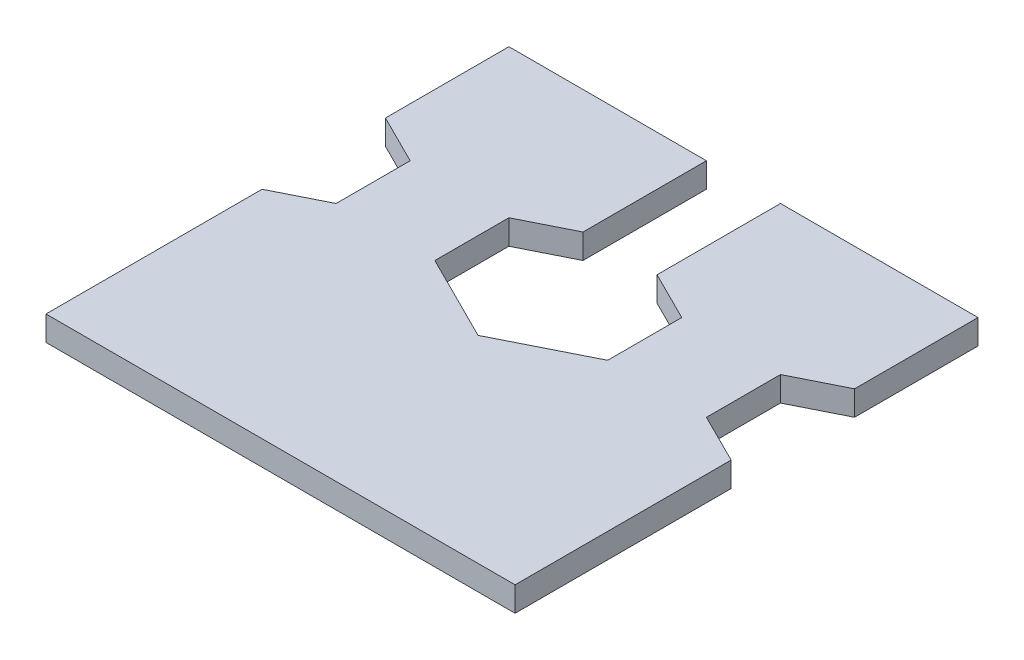
ISO-10303-21;
HEADER;
FILE_DESCRIPTION(('STEP AP214'),'2;1');
FILE_NAME('part.step','',(''),(''),'','','');
FILE_SCHEMA(('AUTOMOTIVE_DESIGN { 1 0 10303 214 1 1 1 1 }'));
ENDSEC;
DATA;
#1=APPLICATION_CONTEXT('core data for automotive mechanical design processes');
#2=APPLICATION_PROTOCOL_DEFINITION('international standard','automotive_design',2000,#1);
#3=PRODUCT_CONTEXT('',#1,'mechanical');
#4=PRODUCT('Part','Part','',(#3));
#5=PRODUCT_RELATED_PRODUCT_CATEGORY('part','',(#4));
#6=PRODUCT_DEFINITION_FORMATION('','',#4);
#7=PRODUCT_DEFINITION_CONTEXT('part definition',#1,'design');
#8=PRODUCT_DEFINITION('design','',#6,#7);
#9=PRODUCT_DEFINITION_SHAPE('','',#8);
#10=(LENGTH_UNIT() NAMED_UNIT(*) SI_UNIT(.MILLI.,.METRE.));
#11=(NAMED_UNIT(*) PLANE_ANGLE_UNIT() SI_UNIT($,.RADIAN.));
#12=(NAMED_UNIT(*) SI_UNIT($,.STERADIAN.) SOLID_ANGLE_UNIT());
#13=UNCERTAINTY_MEASURE_WITH_UNIT(LENGTH_MEASURE(1.E-05),#10,'distance_accuracy_value','');
#14=(GEOMETRIC_REPRESENTATION_CONTEXT(3) GLOBAL_UNCERTAINTY_ASSIGNED_CONTEXT((#13)) GLOBAL_UNIT_ASSIGNED_CONTEXT((#10,
#11,#12)) REPRESENTATION_CONTEXT('',''));
#15=CARTESIAN_POINT('',(0.,0.,0.));
#16=DIRECTION('',(0.,0.,1.));
#17=DIRECTION('',(1.,0.,0.));
#18=AXIS2_PLACEMENT_3D('',#15,#16,#17);
#19=CARTESIAN_POINT('',(-15.,-2.,-19.5007557986155));
#20=DIRECTION('',(-0.447213595499958,0.,-0.894427190999916));
#21=DIRECTION('',(-0.894427190999916,0.,0.447213595499958));
#22=AXIS2_PLACEMENT_3D('',#19,#20,#21);
#23=PLANE('',#22);
#24=DIRECTION('',(-0.894427190999916,0.,0.447213595499958));
#25=VECTOR('',#24,1.);
#26=CARTESIAN_POINT('',(-15.,0.,-19.5007557986155));
#27=LINE('',#26,#25);
#28=CARTESIAN_POINT('',(-15.,0.,-19.5007557986155));
#29=VERTEX_POINT('',#28);
#30=CARTESIAN_POINT('',(-19.,0.,-17.5007557986155));
#31=VERTEX_POINT('',#30);
#32=EDGE_CURVE('E214',#29,#31,#27,.T.);
#33=ORIENTED_EDGE('',*,*,#32,.F.);
#34=DIRECTION('',(0.,1.,0.));
#35=VECTOR('',#34,1.);
#36=CARTESIAN_POINT('',(-15.,-2.,-19.5007557986155));
#37=LINE('',#36,#35);
#38=CARTESIAN_POINT('',(-15.,-2.,-19.5007557986155));
#39=VERTEX_POINT('',#38);
#40=EDGE_CURVE('E11',#39,#29,#37,.T.);
#41=ORIENTED_EDGE('',*,*,#40,.F.);
#42=DIRECTION('',(-0.894427190999916,0.,0.447213595499958));
#43=VECTOR('',#42,1.);
#44=CARTESIAN_POINT('',(-15.,-2.,-19.5007557986155));
#45=LINE('',#44,#43);
#46=CARTESIAN_POINT('',(-19.,-2.,-17.5007557986155));
#47=VERTEX_POINT('',#46);
#48=EDGE_CURVE('E273',#39,#47,#45,.T.);
#49=ORIENTED_EDGE('',*,*,#48,.T.);
#50=DIRECTION('',(0.,1.,0.));
#51=VECTOR('',#50,1.);
#52=CARTESIAN_POINT('',(-19.,-2.,-17.5007557986155));
#53=LINE('',#52,#51);
#54=EDGE_CURVE('E42',#47,#31,#53,.T.);
#55=ORIENTED_EDGE('',*,*,#54,.T.);
#56=EDGE_LOOP('',(#33,#41,#49,#55));
#57=FACE_BOUND('',#56,.T.);
#58=ADVANCED_FACE('F39',(#57),#23,.T.);
#59=CARTESIAN_POINT('',(-15.,-2.,-25.5007557986155));
#60=DIRECTION('',(-1.,0.,0.));
#61=DIRECTION('',(0.,0.,1.));
#62=AXIS2_PLACEMENT_3D('',#59,#60,#61);
#63=PLANE('',#62);
#64=DIRECTION('',(0.,0.,1.));
#65=VECTOR('',#64,1.);
#66=CARTESIAN_POINT('',(-15.,0.,-25.5007557986155));
#67=LINE('',#66,#65);
#68=CARTESIAN_POINT('',(-15.,0.,-25.5007557986155));
#69=VERTEX_POINT('',#68);
#70=EDGE_CURVE('E271',#69,#29,#67,.T.);
#71=ORIENTED_EDGE('',*,*,#70,.F.);
#72=DIRECTION('',(0.,1.,0.));
#73=VECTOR('',#72,1.);
#74=CARTESIAN_POINT('',(-15.,-2.,-25.5007557986155));
#75=LINE('',#74,#73);
#76=CARTESIAN_POINT('',(-15.,-2.,-25.5007557986155));
#77=VERTEX_POINT('',#76);
#78=EDGE_CURVE('E48',#77,#69,#75,.T.);
#79=ORIENTED_EDGE('',*,*,#78,.F.);
#80=DIRECTION('',(0.,0.,1.));
#81=VECTOR('',#80,1.);
#82=CARTESIAN_POINT('',(-15.,-2.,-25.5007557986155));
#83=LINE('',#82,#81);
#84=EDGE_CURVE('E204',#77,#39,#83,.T.);
#85=ORIENTED_EDGE('',*,*,#84,.T.);
#86=ORIENTED_EDGE('',*,*,#40,.T.);
#87=EDGE_LOOP('',(#71,#79,#85,#86));
#88=FACE_BOUND('',#87,.T.);
#89=ADVANCED_FACE('F311',(#88),#63,.T.);
#90=CARTESIAN_POINT('',(-19.,-2.,-27.5007557986155));
#91=DIRECTION('',(-0.447213595499958,0.,0.894427190999916));
#92=DIRECTION('',(0.894427190999916,0.,0.447213595499958));
#93=AXIS2_PLACEMENT_3D('',#90,#91,#92);
#94=PLANE('',#93);
#95=DIRECTION('',(0.894427190999916,0.,0.447213595499958));
#96=VECTOR('',#95,1.);
#97=CARTESIAN_POINT('',(-19.,0.,-27.5007557986155));
#98=LINE('',#97,#96);
#99=CARTESIAN_POINT('',(-19.,0.,-27.5007557986155));
#100=VERTEX_POINT('',#99);
#101=EDGE_CURVE('E191',#100,#69,#98,.T.);
#102=ORIENTED_EDGE('',*,*,#101,.F.);
#103=DIRECTION('',(0.,1.,0.));
#104=VECTOR('',#103,1.);
#105=CARTESIAN_POINT('',(-19.,-2.,-27.5007557986155));
#106=LINE('',#105,#104);
#107=CARTESIAN_POINT('',(-19.,-2.,-27.5007557986155));
#108=VERTEX_POINT('',#107);
#109=EDGE_CURVE('E186',#108,#100,#106,.T.);
#110=ORIENTED_EDGE('',*,*,#109,.F.);
#111=DIRECTION('',(0.894427190999916,0.,0.447213595499958));
#112=VECTOR('',#111,1.);
#113=CARTESIAN_POINT('',(-19.,-2.,-27.5007557986155));
#114=LINE('',#113,#112);
#115=EDGE_CURVE('E189',#108,#77,#114,.T.);
#116=ORIENTED_EDGE('',*,*,#115,.T.);
#117=ORIENTED_EDGE('',*,*,#78,.T.);
#118=EDGE_LOOP('',(#102,#110,#116,#117));
#119=FACE_BOUND('',#118,.T.);
#120=ADVANCED_FACE('F188',(#119),#94,.T.);
#121=CARTESIAN_POINT('',(-19.,-2.,-37.5007557986155));
#122=DIRECTION('',(-1.,0.,0.));
#123=DIRECTION('',(0.,0.,1.));
#124=AXIS2_PLACEMENT_3D('',#121,#122,#123);
#125=PLANE('',#124);
#126=DIRECTION('',(0.,0.,1.));
#127=VECTOR('',#126,1.);
#128=CARTESIAN_POINT('',(-19.,0.,-37.5007557986155));
#129=LINE('',#128,#127);
#130=CARTESIAN_POINT('',(-19.,0.,-37.5007557986155));
#131=VERTEX_POINT('',#130);
#132=EDGE_CURVE('E268',#131,#100,#129,.T.);
#133=ORIENTED_EDGE('',*,*,#132,.F.);
#134=DIRECTION('',(0.,1.,0.));
#135=VECTOR('',#134,1.);
#136=CARTESIAN_POINT('',(-19.,-2.,-37.5007557986155));
#137=LINE('',#136,#135);
#138=CARTESIAN_POINT('',(-19.,-2.,-37.5007557986155));
#139=VERTEX_POINT('',#138);
#140=EDGE_CURVE('E196',#139,#131,#137,.T.);
#141=ORIENTED_EDGE('',*,*,#140,.F.);
#142=DIRECTION('',(0.,0.,1.));
#143=VECTOR('',#142,1.);
#144=CARTESIAN_POINT('',(-19.,-2.,-37.5007557986155));
#145=LINE('',#144,#143);
#146=EDGE_CURVE('E202',#139,#108,#145,.T.);
#147=ORIENTED_EDGE('',*,*,#146,.T.);
#148=ORIENTED_EDGE('',*,*,#109,.T.);
#149=EDGE_LOOP('',(#133,#141,#147,#148));
#150=FACE_BOUND('',#149,.T.);
#151=ADVANCED_FACE('F206',(#150),#125,.T.);
#152=CARTESIAN_POINT('',(-3.,-2.,-37.5007557986155));
#153=DIRECTION('',(0.,0.,-1.));
#154=DIRECTION('',(-1.,0.,0.));
#155=AXIS2_PLACEMENT_3D('',#152,#153,#154);
#156=PLANE('',#155);
#157=DIRECTION('',(-1.,0.,0.));
#158=VECTOR('',#157,1.);
#159=CARTESIAN_POINT('',(-3.,0.,-37.5007557986155));
#160=LINE('',#159,#158);
#161=CARTESIAN_POINT('',(-3.,0.,-37.5007557986155));
#162=VERTEX_POINT('',#161);
#163=EDGE_CURVE('E265',#162,#131,#160,.T.);
#164=ORIENTED_EDGE('',*,*,#163,.F.);
#165=DIRECTION('',(0.,1.,0.));
#166=VECTOR('',#165,1.);
#167=CARTESIAN_POINT('',(-3.,-2.,-37.5007557986155));
#168=LINE('',#167,#166);
#169=CARTESIAN_POINT('',(-3.,-2.,-37.5007557986155));
#170=VERTEX_POINT('',#169);
#171=EDGE_CURVE('E277',#170,#162,#168,.T.);
#172=ORIENTED_EDGE('',*,*,#171,.F.);
#173=DIRECTION('',(-1.,0.,0.));
#174=VECTOR('',#173,1.);
#175=CARTESIAN_POINT('',(-3.,-2.,-37.5007557986155));
#176=LINE('',#175,#174);
#177=EDGE_CURVE('E207',#170,#139,#176,.T.);
#178=ORIENTED_EDGE('',*,*,#177,.T.);
#179=ORIENTED_EDGE('',*,*,#140,.T.);
#180=EDGE_LOOP('',(#164,#172,#178,#179));
#181=FACE_BOUND('',#180,.T.);
#182=ADVANCED_FACE('F324',(#181),#156,.T.);
#183=CARTESIAN_POINT('',(-3.,-2.,-37.5007557986155));
#184=DIRECTION('',(1.,0.,0.));
#185=DIRECTION('',(0.,0.,-1.));
#186=AXIS2_PLACEMENT_3D('',#183,#184,#185);
#187=PLANE('',#186);
#188=DIRECTION('',(0.,0.,-1.));
#189=VECTOR('',#188,1.);
#190=CARTESIAN_POINT('',(-3.,0.,-37.5007557986155));
#191=LINE('',#190,#189);
#192=CARTESIAN_POINT('',(-3.,0.,-27.5007557986155));
#193=VERTEX_POINT('',#192);
#194=EDGE_CURVE('E262',#193,#162,#191,.T.);
#195=ORIENTED_EDGE('',*,*,#194,.F.);
#196=DIRECTION('',(0.,1.,0.));
#197=VECTOR('',#196,1.);
#198=CARTESIAN_POINT('',(-3.,-2.,-27.5007557986155));
#199=LINE('',#198,#197);
#200=CARTESIAN_POINT('',(-3.,-2.,-27.5007557986155));
#201=VERTEX_POINT('',#200);
#202=EDGE_CURVE('E279',#201,#193,#199,.T.);
#203=ORIENTED_EDGE('',*,*,#202,.F.);
#204=DIRECTION('',(0.,0.,-1.));
#205=VECTOR('',#204,1.);
#206=CARTESIAN_POINT('',(-3.,-2.,-37.5007557986155));
#207=LINE('',#206,#205);
#208=EDGE_CURVE('E209',#201,#170,#207,.T.);
#209=ORIENTED_EDGE('',*,*,#208,.T.);
#210=ORIENTED_EDGE('',*,*,#171,.T.);
#211=EDGE_LOOP('',(#195,#203,#209,#210));
#212=FACE_BOUND('',#211,.T.);
#213=ADVANCED_FACE('F327',(#212),#187,.T.);
#214=CARTESIAN_POINT('',(-3.,-2.,-27.5007557986155));
#215=DIRECTION('',(0.447213595499958,0.,0.894427190999916));
#216=DIRECTION('',(0.894427190999916,0.,-0.447213595499958));
#217=AXIS2_PLACEMENT_3D('',#214,#215,#216);
#218=PLANE('',#217);
#219=DIRECTION('',(0.894427190999916,0.,-0.447213595499958));
#220=VECTOR('',#219,1.);
#221=CARTESIAN_POINT('',(-3.,0.,-27.5007557986155));
#222=LINE('',#221,#220);
#223=CARTESIAN_POINT('',(-7.,0.,-25.5007557986155));
#224=VERTEX_POINT('',#223);
#225=EDGE_CURVE('E259',#224,#193,#222,.T.);
#226=ORIENTED_EDGE('',*,*,#225,.F.);
#227=DIRECTION('',(0.,1.,0.));
#228=VECTOR('',#227,1.);
#229=CARTESIAN_POINT('',(-7.,-2.,-25.5007557986155));
#230=LINE('',#229,#228);
#231=CARTESIAN_POINT('',(-7.,-2.,-25.5007557986155));
#232=VERTEX_POINT('',#231);
#233=EDGE_CURVE('E281',#232,#224,#230,.T.);
#234=ORIENTED_EDGE('',*,*,#233,.F.);
#235=DIRECTION('',(0.894427190999916,0.,-0.447213595499958));
#236=VECTOR('',#235,1.);
#237=CARTESIAN_POINT('',(-3.,-2.,-27.5007557986155));
#238=LINE('',#237,#236);
#239=EDGE_CURVE('E622',#232,#201,#238,.T.);
#240=ORIENTED_EDGE('',*,*,#239,.T.);
#241=ORIENTED_EDGE('',*,*,#202,.T.);
#242=EDGE_LOOP('',(#226,#234,#240,#241));
#243=FACE_BOUND('',#242,.T.);
#244=ADVANCED_FACE('F331',(#243),#218,.T.);
#245=CARTESIAN_POINT('',(-7.,-2.,-25.5007557986155));
#246=DIRECTION('',(1.,0.,0.));
#247=DIRECTION('',(0.,0.,-1.));
#248=AXIS2_PLACEMENT_3D('',#245,#246,#247);
#249=PLANE('',#248);
#250=DIRECTION('',(0.,0.,-1.));
#251=VECTOR('',#250,1.);
#252=CARTESIAN_POINT('',(-7.,0.,-25.5007557986155));
#253=LINE('',#252,#251);
#254=CARTESIAN_POINT('',(-7.,0.,-19.5007557986155));
#255=VERTEX_POINT('',#254);
#256=EDGE_CURVE('E256',#255,#224,#253,.T.);
#257=ORIENTED_EDGE('',*,*,#256,.F.);
#258=DIRECTION('',(0.,1.,0.));
#259=VECTOR('',#258,1.);
#260=CARTESIAN_POINT('',(-7.,-2.,-19.5007557986155));
#261=LINE('',#260,#259);
#262=CARTESIAN_POINT('',(-7.,-2.,-19.5007557986155));
#263=VERTEX_POINT('',#262);
#264=EDGE_CURVE('E283',#263,#255,#261,.T.);
#265=ORIENTED_EDGE('',*,*,#264,.F.);
#266=DIRECTION('',(0.,0.,-1.));
#267=VECTOR('',#266,1.);
#268=CARTESIAN_POINT('',(-7.,-2.,-25.5007557986155));
#269=LINE('',#268,#267);
#270=EDGE_CURVE('E626',#263,#232,#269,.T.);
#271=ORIENTED_EDGE('',*,*,#270,.T.);
#272=ORIENTED_EDGE('',*,*,#233,.T.);
#273=EDGE_LOOP('',(#257,#265,#271,#272));
#274=FACE_BOUND('',#273,.T.);
#275=ADVANCED_FACE('F335',(#274),#249,.T.);
#276=CARTESIAN_POINT('',(-7.,-2.,-19.5007557986155));
#277=DIRECTION('',(0.447290848418709,0.,-0.894388560370084));
#278=DIRECTION('',(-0.894388560370084,0.,-0.447290848418709));
#279=AXIS2_PLACEMENT_3D('',#276,#277,#278);
#280=PLANE('',#279);
#281=DIRECTION('',(-0.894388560370084,0.,-0.447290848418709));
#282=VECTOR('',#281,1.);
#283=CARTESIAN_POINT('',(-7.,0.,-19.5007557986155));
#284=LINE('',#283,#282);
#285=CARTESIAN_POINT('',(0.,0.,-16.));
#286=VERTEX_POINT('',#285);
#287=EDGE_CURVE('E253',#286,#255,#284,.T.);
#288=ORIENTED_EDGE('',*,*,#287,.F.);
#289=DIRECTION('',(0.,1.,0.));
#290=VECTOR('',#289,1.);
#291=CARTESIAN_POINT('',(0.,-2.,-16.));
#292=LINE('',#291,#290);
#293=CARTESIAN_POINT('',(0.,-2.,-16.));
#294=VERTEX_POINT('',#293);
#295=EDGE_CURVE('E285',#294,#286,#292,.T.);
#296=ORIENTED_EDGE('',*,*,#295,.F.);
#297=DIRECTION('',(-0.894388560370084,0.,-0.447290848418709));
#298=VECTOR('',#297,1.);
#299=CARTESIAN_POINT('',(-7.,-2.,-19.5007557986155));
#300=LINE('',#299,#298);
#301=EDGE_CURVE('E615',#294,#263,#300,.T.);
#302=ORIENTED_EDGE('',*,*,#301,.T.);
#303=ORIENTED_EDGE('',*,*,#264,.T.);
#304=EDGE_LOOP('',(#288,#296,#302,#303));
#305=FACE_BOUND('',#304,.T.);
#306=ADVANCED_FACE('F339',(#305),#280,.T.);
#307=CARTESIAN_POINT('',(7.,-2.,-19.5007557986155));
#308=DIRECTION('',(-0.447290848418709,0.,-0.894388560370084));
#309=DIRECTION('',(-0.894388560370084,0.,0.447290848418709));
#310=AXIS2_PLACEMENT_3D('',#307,#308,#309);
#311=PLANE('',#310);
#312=DIRECTION('',(-0.894388560370084,0.,0.447290848418709));
#313=VECTOR('',#312,1.);
#314=CARTESIAN_POINT('',(7.,0.,-19.5007557986155));
#315=LINE('',#314,#313);
#316=CARTESIAN_POINT('',(7.,0.,-19.5007557986155));
#317=VERTEX_POINT('',#316);
#318=EDGE_CURVE('E250',#317,#286,#315,.T.);
#319=ORIENTED_EDGE('',*,*,#318,.F.);
#320=DIRECTION('',(0.,1.,0.));
#321=VECTOR('',#320,1.);
#322=CARTESIAN_POINT('',(7.,-2.,-19.5007557986155));
#323=LINE('',#322,#321);
#324=CARTESIAN_POINT('',(7.,-2.,-19.5007557986155));
#325=VERTEX_POINT('',#324);
#326=EDGE_CURVE('E287',#325,#317,#323,.T.);
#327=ORIENTED_EDGE('',*,*,#326,.F.);
#328=DIRECTION('',(-0.894388560370084,0.,0.447290848418709));
#329=VECTOR('',#328,1.);
#330=CARTESIAN_POINT('',(7.,-2.,-19.5007557986155));
#331=LINE('',#330,#329);
#332=EDGE_CURVE('E611',#325,#294,#331,.T.);
#333=ORIENTED_EDGE('',*,*,#332,.T.);
#334=ORIENTED_EDGE('',*,*,#295,.T.);
#335=EDGE_LOOP('',(#319,#327,#333,#334));
#336=FACE_BOUND('',#335,.T.);
#337=ADVANCED_FACE('F343',(#336),#311,.T.);
#338=CARTESIAN_POINT('',(7.,-2.,-25.5007557986155));
#339=DIRECTION('',(-1.,0.,0.));
#340=DIRECTION('',(0.,0.,1.));
#341=AXIS2_PLACEMENT_3D('',#338,#339,#340);
#342=PLANE('',#341);
#343=DIRECTION('',(0.,0.,1.));
#344=VECTOR('',#343,1.);
#345=CARTESIAN_POINT('',(7.,0.,-25.5007557986155));
#346=LINE('',#345,#344);
#347=CARTESIAN_POINT('',(7.,0.,-25.5007557986155));
#348=VERTEX_POINT('',#347);
#349=EDGE_CURVE('E247',#348,#317,#346,.T.);
#350=ORIENTED_EDGE('',*,*,#349,.F.);
#351=DIRECTION('',(0.,1.,0.));
#352=VECTOR('',#351,1.);
#353=CARTESIAN_POINT('',(7.,-2.,-25.5007557986155));
#354=LINE('',#353,#352);
#355=CARTESIAN_POINT('',(7.,-2.,-25.5007557986155));
#356=VERTEX_POINT('',#355);
#357=EDGE_CURVE('E289',#356,#348,#354,.T.);
#358=ORIENTED_EDGE('',*,*,#357,.F.);
#359=DIRECTION('',(0.,0.,1.));
#360=VECTOR('',#359,1.);
#361=CARTESIAN_POINT('',(7.,-2.,-25.5007557986155));
#362=LINE('',#361,#360);
#363=EDGE_CURVE('E632',#356,#325,#362,.T.);
#364=ORIENTED_EDGE('',*,*,#363,.T.);
#365=ORIENTED_EDGE('',*,*,#326,.T.);
#366=EDGE_LOOP('',(#350,#358,#364,#365));
#367=FACE_BOUND('',#366,.T.);
#368=ADVANCED_FACE('F347',(#367),#342,.T.);
#369=CARTESIAN_POINT('',(3.,-2.,-27.5007557986155));
#370=DIRECTION('',(-0.447213595499958,0.,0.894427190999916));
#371=DIRECTION('',(0.894427190999916,0.,0.447213595499958));
#372=AXIS2_PLACEMENT_3D('',#369,#370,#371);
#373=PLANE('',#372);
#374=DIRECTION('',(0.894427190999916,0.,0.447213595499958));
#375=VECTOR('',#374,1.);
#376=CARTESIAN_POINT('',(3.,0.,-27.5007557986155));
#377=LINE('',#376,#375);
#378=CARTESIAN_POINT('',(3.,0.,-27.5007557986155));
#379=VERTEX_POINT('',#378);
#380=EDGE_CURVE('E244',#379,#348,#377,.T.);
#381=ORIENTED_EDGE('',*,*,#380,.F.);
#382=DIRECTION('',(0.,1.,0.));
#383=VECTOR('',#382,1.);
#384=CARTESIAN_POINT('',(3.,-2.,-27.5007557986155));
#385=LINE('',#384,#383);
#386=CARTESIAN_POINT('',(3.,-2.,-27.5007557986155));
#387=VERTEX_POINT('',#386);
#388=EDGE_CURVE('E291',#387,#379,#385,.T.);
#389=ORIENTED_EDGE('',*,*,#388,.F.);
#390=DIRECTION('',(0.894427190999916,0.,0.447213595499958));
#391=VECTOR('',#390,1.);
#392=CARTESIAN_POINT('',(3.,-2.,-27.5007557986155));
#393=LINE('',#392,#391);
#394=EDGE_CURVE('E604',#387,#356,#393,.T.);
#395=ORIENTED_EDGE('',*,*,#394,.T.);
#396=ORIENTED_EDGE('',*,*,#357,.T.);
#397=EDGE_LOOP('',(#381,#389,#395,#396));
#398=FACE_BOUND('',#397,.T.);
#399=ADVANCED_FACE('F351',(#398),#373,.T.);
#400=CARTESIAN_POINT('',(3.,-2.,-37.5007557986155));
#401=DIRECTION('',(-1.,0.,0.));
#402=DIRECTION('',(0.,0.,1.));
#403=AXIS2_PLACEMENT_3D('',#400,#401,#402);
#404=PLANE('',#403);
#405=DIRECTION('',(0.,0.,1.));
#406=VECTOR('',#405,1.);
#407=CARTESIAN_POINT('',(3.,0.,-37.5007557986155));
#408=LINE('',#407,#406);
#409=CARTESIAN_POINT('',(3.,0.,-37.5007557986155));
#410=VERTEX_POINT('',#409);
#411=EDGE_CURVE('E241',#410,#379,#408,.T.);
#412=ORIENTED_EDGE('',*,*,#411,.F.);
#413=DIRECTION('',(0.,1.,0.));
#414=VECTOR('',#413,1.);
#415=CARTESIAN_POINT('',(3.,-2.,-37.5007557986155));
#416=LINE('',#415,#414);
#417=CARTESIAN_POINT('',(3.,-2.,-37.5007557986155));
#418=VERTEX_POINT('',#417);
#419=EDGE_CURVE('E293',#418,#410,#416,.T.);
#420=ORIENTED_EDGE('',*,*,#419,.F.);
#421=DIRECTION('',(0.,0.,1.));
#422=VECTOR('',#421,1.);
#423=CARTESIAN_POINT('',(3.,-2.,-37.5007557986155));
#424=LINE('',#423,#422);
#425=EDGE_CURVE('E600',#418,#387,#424,.T.);
#426=ORIENTED_EDGE('',*,*,#425,.T.);
#427=ORIENTED_EDGE('',*,*,#388,.T.);
#428=EDGE_LOOP('',(#412,#420,#426,#427));
#429=FACE_BOUND('',#428,.T.);
#430=ADVANCED_FACE('F355',(#429),#404,.T.);
#431=CARTESIAN_POINT('',(3.,-2.,-37.5007557986155));
#432=DIRECTION('',(0.,0.,-1.));
#433=DIRECTION('',(-1.,0.,0.));
#434=AXIS2_PLACEMENT_3D('',#431,#432,#433);
#435=PLANE('',#434);
#436=DIRECTION('',(-1.,0.,0.));
#437=VECTOR('',#436,1.);
#438=CARTESIAN_POINT('',(3.,0.,-37.5007557986155));
#439=LINE('',#438,#437);
#440=CARTESIAN_POINT('',(19.,0.,-37.5007557986155));
#441=VERTEX_POINT('',#440);
#442=EDGE_CURVE('E238',#441,#410,#439,.T.);
#443=ORIENTED_EDGE('',*,*,#442,.F.);
#444=DIRECTION('',(0.,1.,0.));
#445=VECTOR('',#444,1.);
#446=CARTESIAN_POINT('',(19.,-2.,-37.5007557986155));
#447=LINE('',#446,#445);
#448=CARTESIAN_POINT('',(19.,-2.,-37.5007557986155));
#449=VERTEX_POINT('',#448);
#450=EDGE_CURVE('E295',#449,#441,#447,.T.);
#451=ORIENTED_EDGE('',*,*,#450,.F.);
#452=DIRECTION('',(-1.,0.,0.));
#453=VECTOR('',#452,1.);
#454=CARTESIAN_POINT('',(3.,-2.,-37.5007557986155));
#455=LINE('',#454,#453);
#456=EDGE_CURVE('E636',#449,#418,#455,.T.);
#457=ORIENTED_EDGE('',*,*,#456,.T.);
#458=ORIENTED_EDGE('',*,*,#419,.T.);
#459=EDGE_LOOP('',(#443,#451,#457,#458));
#460=FACE_BOUND('',#459,.T.);
#461=ADVANCED_FACE('F359',(#460),#435,.T.);
#462=CARTESIAN_POINT('',(19.,-2.,-37.5007557986155));
#463=DIRECTION('',(1.,0.,0.));
#464=DIRECTION('',(0.,0.,-1.));
#465=AXIS2_PLACEMENT_3D('',#462,#463,#464);
#466=PLANE('',#465);
#467=DIRECTION('',(0.,0.,-1.));
#468=VECTOR('',#467,1.);
#469=CARTESIAN_POINT('',(19.,0.,-37.5007557986155));
#470=LINE('',#469,#468);
#471=CARTESIAN_POINT('',(19.,0.,-27.5007557986155));
#472=VERTEX_POINT('',#471);
#473=EDGE_CURVE('E235',#472,#441,#470,.T.);
#474=ORIENTED_EDGE('',*,*,#473,.F.);
#475=DIRECTION('',(0.,1.,0.));
#476=VECTOR('',#475,1.);
#477=CARTESIAN_POINT('',(19.,-2.,-27.5007557986155));
#478=LINE('',#477,#476);
#479=CARTESIAN_POINT('',(19.,-2.,-27.5007557986155));
#480=VERTEX_POINT('',#479);
#481=EDGE_CURVE('E297',#480,#472,#478,.T.);
#482=ORIENTED_EDGE('',*,*,#481,.F.);
#483=DIRECTION('',(0.,0.,-1.));
#484=VECTOR('',#483,1.);
#485=CARTESIAN_POINT('',(19.,-2.,-37.5007557986155));
#486=LINE('',#485,#484);
#487=EDGE_CURVE('E593',#480,#449,#486,.T.);
#488=ORIENTED_EDGE('',*,*,#487,.T.);
#489=ORIENTED_EDGE('',*,*,#450,.T.);
#490=EDGE_LOOP('',(#474,#482,#488,#489));
#491=FACE_BOUND('',#490,.T.);
#492=ADVANCED_FACE('F363',(#491),#466,.T.);
#493=CARTESIAN_POINT('',(19.,-2.,-27.5007557986155));
#494=DIRECTION('',(0.447213595499958,0.,0.894427190999916));
#495=DIRECTION('',(0.894427190999916,0.,-0.447213595499958));
#496=AXIS2_PLACEMENT_3D('',#493,#494,#495);
#497=PLANE('',#496);
#498=DIRECTION('',(0.894427190999916,0.,-0.447213595499958));
#499=VECTOR('',#498,1.);
#500=CARTESIAN_POINT('',(19.,0.,-27.5007557986155));
#501=LINE('',#500,#499);
#502=CARTESIAN_POINT('',(15.,0.,-25.5007557986155));
#503=VERTEX_POINT('',#502);
#504=EDGE_CURVE('E232',#503,#472,#501,.T.);
#505=ORIENTED_EDGE('',*,*,#504,.F.);
#506=DIRECTION('',(0.,1.,0.));
#507=VECTOR('',#506,1.);
#508=CARTESIAN_POINT('',(15.,-2.,-25.5007557986155));
#509=LINE('',#508,#507);
#510=CARTESIAN_POINT('',(15.,-2.,-25.5007557986155));
#511=VERTEX_POINT('',#510);
#512=EDGE_CURVE('E299',#511,#503,#509,.T.);
#513=ORIENTED_EDGE('',*,*,#512,.F.);
#514=DIRECTION('',(0.894427190999916,0.,-0.447213595499958));
#515=VECTOR('',#514,1.);
#516=CARTESIAN_POINT('',(19.,-2.,-27.5007557986155));
#517=LINE('',#516,#515);
#518=EDGE_CURVE('E589',#511,#480,#517,.T.);
#519=ORIENTED_EDGE('',*,*,#518,.T.);
#520=ORIENTED_EDGE('',*,*,#481,.T.);
#521=EDGE_LOOP('',(#505,#513,#519,#520));
#522=FACE_BOUND('',#521,.T.);
#523=ADVANCED_FACE('F367',(#522),#497,.T.);
#524=CARTESIAN_POINT('',(15.,-2.,-25.5007557986155));
#525=DIRECTION('',(1.,0.,0.));
#526=DIRECTION('',(0.,0.,-1.));
#527=AXIS2_PLACEMENT_3D('',#524,#525,#526);
#528=PLANE('',#527);
#529=DIRECTION('',(0.,0.,-1.));
#530=VECTOR('',#529,1.);
#531=CARTESIAN_POINT('',(15.,0.,-25.5007557986155));
#532=LINE('',#531,#530);
#533=CARTESIAN_POINT('',(15.,0.,-19.5007557986155));
#534=VERTEX_POINT('',#533);
#535=EDGE_CURVE('E229',#534,#503,#532,.T.);
#536=ORIENTED_EDGE('',*,*,#535,.F.);
#537=DIRECTION('',(0.,1.,0.));
#538=VECTOR('',#537,1.);
#539=CARTESIAN_POINT('',(15.,-2.,-19.5007557986155));
#540=LINE('',#539,#538);
#541=CARTESIAN_POINT('',(15.,-2.,-19.5007557986155));
#542=VERTEX_POINT('',#541);
#543=EDGE_CURVE('E301',#542,#534,#540,.T.);
#544=ORIENTED_EDGE('',*,*,#543,.F.);
#545=DIRECTION('',(0.,0.,-1.));
#546=VECTOR('',#545,1.);
#547=CARTESIAN_POINT('',(15.,-2.,-25.5007557986155));
#548=LINE('',#547,#546);
#549=EDGE_CURVE('E640',#542,#511,#548,.T.);
#550=ORIENTED_EDGE('',*,*,#549,.T.);
#551=ORIENTED_EDGE('',*,*,#512,.T.);
#552=EDGE_LOOP('',(#536,#544,#550,#551));
#553=FACE_BOUND('',#552,.T.);
#554=ADVANCED_FACE('F371',(#553),#528,.T.);
#555=CARTESIAN_POINT('',(15.,-2.,-19.5007557986155));
#556=DIRECTION('',(0.447213595499958,0.,-0.894427190999916));
#557=DIRECTION('',(-0.894427190999916,0.,-0.447213595499958));
#558=AXIS2_PLACEMENT_3D('',#555,#556,#557);
#559=PLANE('',#558);
#560=DIRECTION('',(-0.894427190999916,0.,-0.447213595499958));
#561=VECTOR('',#560,1.);
#562=CARTESIAN_POINT('',(15.,0.,-19.5007557986155));
#563=LINE('',#562,#561);
#564=CARTESIAN_POINT('',(19.,0.,-17.5007557986155));
#565=VERTEX_POINT('',#564);
#566=EDGE_CURVE('E226',#565,#534,#563,.T.);
#567=ORIENTED_EDGE('',*,*,#566,.F.);
#568=DIRECTION('',(0.,1.,0.));
#569=VECTOR('',#568,1.);
#570=CARTESIAN_POINT('',(19.,-2.,-17.5007557986155));
#571=LINE('',#570,#569);
#572=CARTESIAN_POINT('',(19.,-2.,-17.5007557986155));
#573=VERTEX_POINT('',#572);
#574=EDGE_CURVE('E303',#573,#565,#571,.T.);
#575=ORIENTED_EDGE('',*,*,#574,.F.);
#576=DIRECTION('',(-0.894427190999916,0.,-0.447213595499958));
#577=VECTOR('',#576,1.);
#578=CARTESIAN_POINT('',(15.,-2.,-19.5007557986155));
#579=LINE('',#578,#577);
#580=EDGE_CURVE('E582',#573,#542,#579,.T.);
#581=ORIENTED_EDGE('',*,*,#580,.T.);
#582=ORIENTED_EDGE('',*,*,#543,.T.);
#583=EDGE_LOOP('',(#567,#575,#581,#582));
#584=FACE_BOUND('',#583,.T.);
#585=ADVANCED_FACE('F375',(#584),#559,.T.);
#586=CARTESIAN_POINT('',(19.,-2.,-17.5007557986155));
#587=DIRECTION('',(1.,0.,0.));
#588=DIRECTION('',(0.,0.,-1.));
#589=AXIS2_PLACEMENT_3D('',#586,#587,#588);
#590=PLANE('',#589);
#591=DIRECTION('',(0.,0.,-1.));
#592=VECTOR('',#591,1.);
#593=CARTESIAN_POINT('',(19.,0.,-17.5007557986155));
#594=LINE('',#593,#592);
#595=CARTESIAN_POINT('',(19.,0.,0.));
#596=VERTEX_POINT('',#595);
#597=EDGE_CURVE('E223',#596,#565,#594,.T.);
#598=ORIENTED_EDGE('',*,*,#597,.F.);
#599=DIRECTION('',(0.,1.,0.));
#600=VECTOR('',#599,1.);
#601=CARTESIAN_POINT('',(19.,-2.,0.));
#602=LINE('',#601,#600);
#603=CARTESIAN_POINT('',(19.,-2.,0.));
#604=VERTEX_POINT('',#603);
#605=EDGE_CURVE('E305',#604,#596,#602,.T.);
#606=ORIENTED_EDGE('',*,*,#605,.F.);
#607=DIRECTION('',(0.,0.,-1.));
#608=VECTOR('',#607,1.);
#609=CARTESIAN_POINT('',(19.,-2.,-17.5007557986155));
#610=LINE('',#609,#608);
#611=EDGE_CURVE('E578',#604,#573,#610,.T.);
#612=ORIENTED_EDGE('',*,*,#611,.T.);
#613=ORIENTED_EDGE('',*,*,#574,.T.);
#614=EDGE_LOOP('',(#598,#606,#612,#613));
#615=FACE_BOUND('',#614,.T.);
#616=ADVANCED_FACE('F379',(#615),#590,.T.);
#617=CARTESIAN_POINT('',(19.,-2.,0.));
#618=DIRECTION('',(0.,0.,1.));
#619=DIRECTION('',(1.,0.,0.));
#620=AXIS2_PLACEMENT_3D('',#617,#618,#619);
#621=PLANE('',#620);
#622=DIRECTION('',(1.,0.,0.));
#623=VECTOR('',#622,1.);
#624=CARTESIAN_POINT('',(19.,0.,0.));
#625=LINE('',#624,#623);
#626=CARTESIAN_POINT('',(-19.,0.,0.));
#627=VERTEX_POINT('',#626);
#628=EDGE_CURVE('E220',#627,#596,#625,.T.);
#629=ORIENTED_EDGE('',*,*,#628,.F.);
#630=DIRECTION('',(0.,1.,0.));
#631=VECTOR('',#630,1.);
#632=CARTESIAN_POINT('',(-19.,-2.,0.));
#633=LINE('',#632,#631);
#634=CARTESIAN_POINT('',(-19.,-2.,0.));
#635=VERTEX_POINT('',#634);
#636=EDGE_CURVE('E306',#635,#627,#633,.T.);
#637=ORIENTED_EDGE('',*,*,#636,.F.);
#638=DIRECTION('',(1.,0.,0.));
#639=VECTOR('',#638,1.);
#640=CARTESIAN_POINT('',(19.,-2.,0.));
#641=LINE('',#640,#639);
#642=EDGE_CURVE('E644',#635,#604,#641,.T.);
#643=ORIENTED_EDGE('',*,*,#642,.T.);
#644=ORIENTED_EDGE('',*,*,#605,.T.);
#645=EDGE_LOOP('',(#629,#637,#643,#644));
#646=FACE_BOUND('',#645,.T.);
#647=ADVANCED_FACE('F383',(#646),#621,.T.);
#648=CARTESIAN_POINT('',(-19.,-2.,-17.5007557986155));
#649=DIRECTION('',(-1.,0.,0.));
#650=DIRECTION('',(0.,0.,1.));
#651=AXIS2_PLACEMENT_3D('',#648,#649,#650);
#652=PLANE('',#651);
#653=DIRECTION('',(0.,0.,1.));
#654=VECTOR('',#653,1.);
#655=CARTESIAN_POINT('',(-19.,0.,-17.5007557986155));
#656=LINE('',#655,#654);
#657=EDGE_CURVE('E217',#31,#627,#656,.T.);
#658=ORIENTED_EDGE('',*,*,#657,.F.);
#659=ORIENTED_EDGE('',*,*,#54,.F.);
#660=DIRECTION('',(0.,0.,1.));
#661=VECTOR('',#660,1.);
#662=CARTESIAN_POINT('',(-19.,-2.,-17.5007557986155));
#663=LINE('',#662,#661);
#664=EDGE_CURVE('E646',#47,#635,#663,.T.);
#665=ORIENTED_EDGE('',*,*,#664,.T.);
#666=ORIENTED_EDGE('',*,*,#636,.T.);
#667=EDGE_LOOP('',(#658,#659,#665,#666));
#668=FACE_BOUND('',#667,.T.);
#669=ADVANCED_FACE('F308',(#668),#652,.T.);
#670=CARTESIAN_POINT('',(0.,-2.,0.));
#671=DIRECTION('',(0.,1.,0.));
#672=DIRECTION('',(0.,0.,1.));
#673=AXIS2_PLACEMENT_3D('',#670,#671,#672);
#674=PLANE('',#673);
#675=ORIENTED_EDGE('',*,*,#48,.F.);
#676=ORIENTED_EDGE('',*,*,#84,.F.);
#677=ORIENTED_EDGE('',*,*,#115,.F.);
#678=ORIENTED_EDGE('',*,*,#146,.F.);
#679=ORIENTED_EDGE('',*,*,#177,.F.);
#680=ORIENTED_EDGE('',*,*,#208,.F.);
#681=ORIENTED_EDGE('',*,*,#239,.F.);
#682=ORIENTED_EDGE('',*,*,#270,.F.);
#683=ORIENTED_EDGE('',*,*,#301,.F.);
#684=ORIENTED_EDGE('',*,*,#332,.F.);
#685=ORIENTED_EDGE('',*,*,#363,.F.);
#686=ORIENTED_EDGE('',*,*,#394,.F.);
#687=ORIENTED_EDGE('',*,*,#425,.F.);
#688=ORIENTED_EDGE('',*,*,#456,.F.);
#689=ORIENTED_EDGE('',*,*,#487,.F.);
#690=ORIENTED_EDGE('',*,*,#518,.F.);
#691=ORIENTED_EDGE('',*,*,#549,.F.);
#692=ORIENTED_EDGE('',*,*,#580,.F.);
#693=ORIENTED_EDGE('',*,*,#611,.F.);
#694=ORIENTED_EDGE('',*,*,#642,.F.);
#695=ORIENTED_EDGE('',*,*,#664,.F.);
#696=EDGE_LOOP('',(#675,#676,#677,#678,#679,#680,#681,#682,#683,#684,#685,#686,#687,#688,#689,
#690,#691,#692,#693,#694,#695));
#697=FACE_BOUND('',#696,.T.);
#698=ADVANCED_FACE('F200',(#697),#674,.F.);
#699=CARTESIAN_POINT('',(0.,0.,0.));
#700=DIRECTION('',(0.,1.,0.));
#701=DIRECTION('',(0.,0.,1.));
#702=AXIS2_PLACEMENT_3D('',#699,#700,#701);
#703=PLANE('',#702);
#704=ORIENTED_EDGE('',*,*,#32,.T.);
#705=ORIENTED_EDGE('',*,*,#657,.T.);
#706=ORIENTED_EDGE('',*,*,#628,.T.);
#707=ORIENTED_EDGE('',*,*,#597,.T.);
#708=ORIENTED_EDGE('',*,*,#566,.T.);
#709=ORIENTED_EDGE('',*,*,#535,.T.);
#710=ORIENTED_EDGE('',*,*,#504,.T.);
#711=ORIENTED_EDGE('',*,*,#473,.T.);
#712=ORIENTED_EDGE('',*,*,#442,.T.);
#713=ORIENTED_EDGE('',*,*,#411,.T.);
#714=ORIENTED_EDGE('',*,*,#380,.T.);
#715=ORIENTED_EDGE('',*,*,#349,.T.);
#716=ORIENTED_EDGE('',*,*,#318,.T.);
#717=ORIENTED_EDGE('',*,*,#287,.T.);
#718=ORIENTED_EDGE('',*,*,#256,.T.);
#719=ORIENTED_EDGE('',*,*,#225,.T.);
#720=ORIENTED_EDGE('',*,*,#194,.T.);
#721=ORIENTED_EDGE('',*,*,#163,.T.);
#722=ORIENTED_EDGE('',*,*,#132,.T.);
#723=ORIENTED_EDGE('',*,*,#101,.T.);
#724=ORIENTED_EDGE('',*,*,#70,.T.);
#725=EDGE_LOOP('',(#704,#705,#706,#707,#708,#709,#710,#711,#712,#713,#714,#715,#716,#717,#718,
#719,#720,#721,#722,#723,#724));
#726=FACE_BOUND('',#725,.T.);
#727=ADVANCED_FACE('F310',(#726),#703,.T.);
#728=CLOSED_SHELL('',(#58,#89,#120,#151,#182,#213,#244,#275,#306,#337,#368,#399,#430,#461,#492,
#523,#554,#585,#616,#647,#669,#698,#727));
#729=MANIFOLD_SOLID_BREP('B2',#728);
#730=ADVANCED_BREP_SHAPE_REPRESENTATION('',(#18,#729),#14);
#731=SHAPE_DEFINITION_REPRESENTATION(#9,#730);
ENDSEC;
END-ISO-10303-21;
